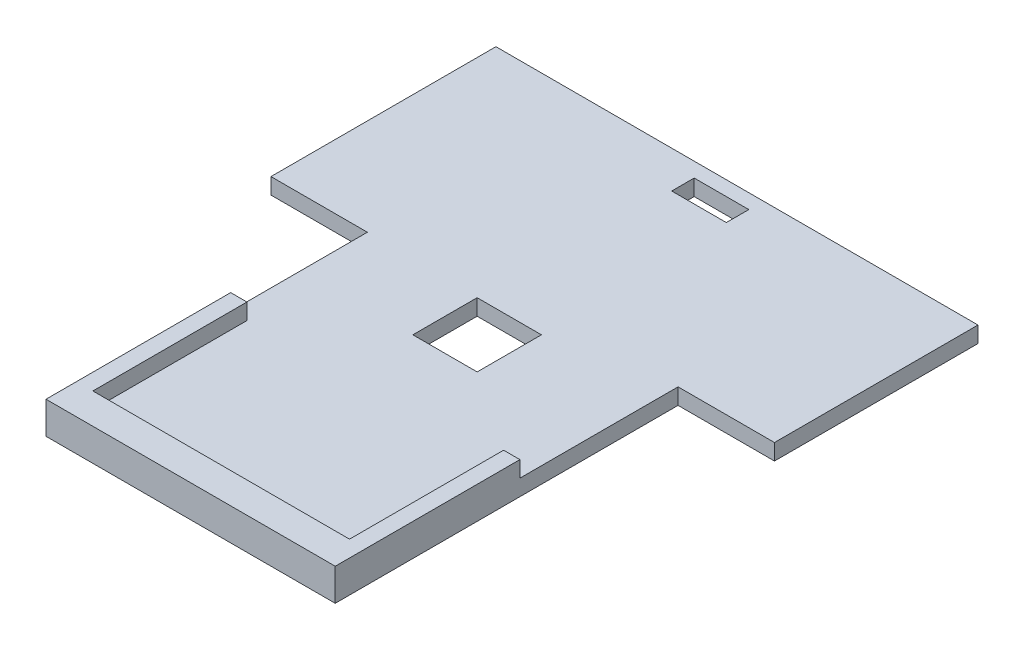
ISO-10303-21;
HEADER;
FILE_DESCRIPTION(('STEP AP214'),'2;1');
FILE_NAME('part.step','',(''),(''),'','','');
FILE_SCHEMA(('AUTOMOTIVE_DESIGN { 1 0 10303 214 1 1 1 1 }'));
ENDSEC;
DATA;
#1=APPLICATION_CONTEXT('core data for automotive mechanical design processes');
#2=APPLICATION_PROTOCOL_DEFINITION('international standard','automotive_design',2000,#1);
#3=PRODUCT_CONTEXT('',#1,'mechanical');
#4=PRODUCT('Part','Part','',(#3));
#5=PRODUCT_RELATED_PRODUCT_CATEGORY('part','',(#4));
#6=PRODUCT_DEFINITION_FORMATION('','',#4);
#7=PRODUCT_DEFINITION_CONTEXT('part definition',#1,'design');
#8=PRODUCT_DEFINITION('design','',#6,#7);
#9=PRODUCT_DEFINITION_SHAPE('','',#8);
#10=(LENGTH_UNIT() NAMED_UNIT(*) SI_UNIT(.MILLI.,.METRE.));
#11=(NAMED_UNIT(*) PLANE_ANGLE_UNIT() SI_UNIT($,.RADIAN.));
#12=(NAMED_UNIT(*) SI_UNIT($,.STERADIAN.) SOLID_ANGLE_UNIT());
#13=UNCERTAINTY_MEASURE_WITH_UNIT(LENGTH_MEASURE(1.E-05),#10,'distance_accuracy_value','');
#14=(GEOMETRIC_REPRESENTATION_CONTEXT(3) GLOBAL_UNCERTAINTY_ASSIGNED_CONTEXT((#13)) GLOBAL_UNIT_ASSIGNED_CONTEXT((#10,
#11,#12)) REPRESENTATION_CONTEXT('',''));
#15=CARTESIAN_POINT('',(0.,0.,0.));
#16=DIRECTION('',(0.,0.,1.));
#17=DIRECTION('',(1.,0.,0.));
#18=AXIS2_PLACEMENT_3D('',#15,#16,#17);
#19=CARTESIAN_POINT('',(0.,5.,0.));
#20=DIRECTION('',(0.,-1.,0.));
#21=DIRECTION('',(0.,0.,-1.));
#22=AXIS2_PLACEMENT_3D('',#19,#20,#21);
#23=PLANE('',#22);
#24=DIRECTION('',(0.,0.,-1.));
#25=VECTOR('',#24,1.);
#26=CARTESIAN_POINT('',(8.5210181174456,5.,-69.0142627843914));
#27=LINE('',#26,#25);
#28=CARTESIAN_POINT('',(8.5210181174456,5.,-69.0142627843914));
#29=VERTEX_POINT('',#28);
#30=CARTESIAN_POINT('',(8.5210181174456,5.,-76.0142627843914));
#31=VERTEX_POINT('',#30);
#32=EDGE_CURVE('E278',#29,#31,#27,.T.);
#33=ORIENTED_EDGE('',*,*,#32,.F.);
#34=DIRECTION('',(1.,0.,0.));
#35=VECTOR('',#34,1.);
#36=CARTESIAN_POINT('',(-8.4789818825544,5.,-69.0142627843914));
#37=LINE('',#36,#35);
#38=CARTESIAN_POINT('',(-8.4789818825544,5.,-69.0142627843914));
#39=VERTEX_POINT('',#38);
#40=EDGE_CURVE('E286',#39,#29,#37,.T.);
#41=ORIENTED_EDGE('',*,*,#40,.F.);
#42=DIRECTION('',(0.,0.,1.));
#43=VECTOR('',#42,1.);
#44=CARTESIAN_POINT('',(-8.4789818825544,5.,-69.0142627843914));
#45=LINE('',#44,#43);
#46=CARTESIAN_POINT('',(-8.4789818825544,5.,-76.0142627843914));
#47=VERTEX_POINT('',#46);
#48=EDGE_CURVE('E283',#47,#39,#45,.T.);
#49=ORIENTED_EDGE('',*,*,#48,.F.);
#50=DIRECTION('',(-1.,0.,0.));
#51=VECTOR('',#50,1.);
#52=CARTESIAN_POINT('',(-8.4789818825544,5.,-76.0142627843914));
#53=LINE('',#52,#51);
#54=EDGE_CURVE('E280',#31,#47,#53,.T.);
#55=ORIENTED_EDGE('',*,*,#54,.F.);
#56=EDGE_LOOP('',(#33,#41,#49,#55));
#57=FACE_BOUND('',#56,.T.);
#58=DIRECTION('',(-1.,0.,0.));
#59=VECTOR('',#58,1.);
#60=CARTESIAN_POINT('',(-10.,5.,-10.));
#61=LINE('',#60,#59);
#62=CARTESIAN_POINT('',(10.,5.,-10.));
#63=VERTEX_POINT('',#62);
#64=CARTESIAN_POINT('',(-10.,5.,-10.));
#65=VERTEX_POINT('',#64);
#66=EDGE_CURVE('E261',#63,#65,#61,.T.);
#67=ORIENTED_EDGE('',*,*,#66,.F.);
#68=DIRECTION('',(0.,0.,-1.));
#69=VECTOR('',#68,1.);
#70=CARTESIAN_POINT('',(10.,5.,10.));
#71=LINE('',#70,#69);
#72=CARTESIAN_POINT('',(10.,5.,10.));
#73=VERTEX_POINT('',#72);
#74=EDGE_CURVE('E205',#73,#63,#71,.T.);
#75=ORIENTED_EDGE('',*,*,#74,.F.);
#76=DIRECTION('',(1.,0.,0.));
#77=VECTOR('',#76,1.);
#78=CARTESIAN_POINT('',(-10.,5.,10.));
#79=LINE('',#78,#77);
#80=CARTESIAN_POINT('',(-10.,5.,10.));
#81=VERTEX_POINT('',#80);
#82=EDGE_CURVE('E250',#81,#73,#79,.T.);
#83=ORIENTED_EDGE('',*,*,#82,.F.);
#84=DIRECTION('',(0.,0.,1.));
#85=VECTOR('',#84,1.);
#86=CARTESIAN_POINT('',(-10.,5.,10.));
#87=LINE('',#86,#85);
#88=EDGE_CURVE('E264',#65,#81,#87,.T.);
#89=ORIENTED_EDGE('',*,*,#88,.F.);
#90=EDGE_LOOP('',(#67,#75,#83,#89));
#91=FACE_BOUND('',#90,.T.);
#92=DIRECTION('',(-1.,0.,0.));
#93=VECTOR('',#92,1.);
#94=CARTESIAN_POINT('',(-39.6505437221671,5.,31.9751991133616));
#95=LINE('',#94,#93);
#96=CARTESIAN_POINT('',(-39.6505437221671,5.,31.9751991133616));
#97=VERTEX_POINT('',#96);
#98=CARTESIAN_POINT('',(-44.7189818825544,5.,31.9751991133615));
#99=VERTEX_POINT('',#98);
#100=EDGE_CURVE('E53',#97,#99,#95,.T.);
#101=ORIENTED_EDGE('',*,*,#100,.F.);
#102=DIRECTION('',(0.,0.,-1.));
#103=VECTOR('',#102,1.);
#104=CARTESIAN_POINT('',(-39.6505437221671,5.,31.9751991133616));
#105=LINE('',#104,#103);
#106=CARTESIAN_POINT('',(-39.6505437221671,5.,79.9218394482392));
#107=VERTEX_POINT('',#106);
#108=EDGE_CURVE('E57',#107,#97,#105,.T.);
#109=ORIENTED_EDGE('',*,*,#108,.F.);
#110=DIRECTION('',(-1.,0.,0.));
#111=VECTOR('',#110,1.);
#112=CARTESIAN_POINT('',(-39.6505437221671,5.,79.9218394482392));
#113=LINE('',#112,#111);
#114=CARTESIAN_POINT('',(40.2125799570584,5.,79.9218394482392));
#115=VERTEX_POINT('',#114);
#116=EDGE_CURVE('E230',#115,#107,#113,.T.);
#117=ORIENTED_EDGE('',*,*,#116,.F.);
#118=DIRECTION('',(0.,0.,1.));
#119=VECTOR('',#118,1.);
#120=CARTESIAN_POINT('',(40.2125799570584,5.,31.9751991133616));
#121=LINE('',#120,#119);
#122=CARTESIAN_POINT('',(40.2125799570584,5.,31.9751991133616));
#123=VERTEX_POINT('',#122);
#124=EDGE_CURVE('E227',#123,#115,#121,.T.);
#125=ORIENTED_EDGE('',*,*,#124,.F.);
#126=DIRECTION('',(-1.,0.,0.));
#127=VECTOR('',#126,1.);
#128=CARTESIAN_POINT('',(40.2125799570584,5.,31.9751991133616));
#129=LINE('',#128,#127);
#130=CARTESIAN_POINT('',(45.2810181174456,5.,31.9751991133616));
#131=VERTEX_POINT('',#130);
#132=EDGE_CURVE('E225',#131,#123,#129,.T.);
#133=ORIENTED_EDGE('',*,*,#132,.F.);
#134=DIRECTION('',(0.,0.,-1.));
#135=VECTOR('',#134,1.);
#136=CARTESIAN_POINT('',(45.2810181174456,5.,-17.235484444561));
#137=LINE('',#136,#135);
#138=CARTESIAN_POINT('',(45.2810181174456,5.,-17.235484444561));
#139=VERTEX_POINT('',#138);
#140=EDGE_CURVE('E202',#131,#139,#137,.T.);
#141=ORIENTED_EDGE('',*,*,#140,.T.);
#142=DIRECTION('',(1.,0.,0.));
#143=VECTOR('',#142,1.);
#144=CARTESIAN_POINT('',(75.2810181174456,5.,-17.235484444561));
#145=LINE('',#144,#143);
#146=CARTESIAN_POINT('',(75.2810181174456,5.,-17.235484444561));
#147=VERTEX_POINT('',#146);
#148=EDGE_CURVE('E322',#139,#147,#145,.T.);
#149=ORIENTED_EDGE('',*,*,#148,.T.);
#150=DIRECTION('',(0.,0.,-1.));
#151=VECTOR('',#150,1.);
#152=CARTESIAN_POINT('',(75.2810181174456,5.,-17.235484444561));
#153=LINE('',#152,#151);
#154=CARTESIAN_POINT('',(75.2810181174456,5.,-80.5642627843914));
#155=VERTEX_POINT('',#154);
#156=EDGE_CURVE('E309',#147,#155,#153,.T.);
#157=ORIENTED_EDGE('',*,*,#156,.T.);
#158=DIRECTION('',(-1.,0.,0.));
#159=VECTOR('',#158,1.);
#160=CARTESIAN_POINT('',(-74.7189818825544,5.,-80.5642627843914));
#161=LINE('',#160,#159);
#162=CARTESIAN_POINT('',(-74.7189818825544,5.,-80.5642627843914));
#163=VERTEX_POINT('',#162);
#164=EDGE_CURVE('E312',#155,#163,#161,.T.);
#165=ORIENTED_EDGE('',*,*,#164,.T.);
#166=DIRECTION('',(0.,0.,1.));
#167=VECTOR('',#166,1.);
#168=CARTESIAN_POINT('',(-74.7189818825544,5.,-10.5642627843914));
#169=LINE('',#168,#167);
#170=CARTESIAN_POINT('',(-74.7189818825544,5.,-10.5642627843914));
#171=VERTEX_POINT('',#170);
#172=EDGE_CURVE('E315',#163,#171,#169,.T.);
#173=ORIENTED_EDGE('',*,*,#172,.T.);
#174=DIRECTION('',(1.,0.,0.));
#175=VECTOR('',#174,1.);
#176=CARTESIAN_POINT('',(-74.7189818825544,5.,-10.5642627843914));
#177=LINE('',#176,#175);
#178=CARTESIAN_POINT('',(-44.7189818825544,5.,-10.5642627843914));
#179=VERTEX_POINT('',#178);
#180=EDGE_CURVE('E317',#171,#179,#177,.T.);
#181=ORIENTED_EDGE('',*,*,#180,.T.);
#182=DIRECTION('',(0.,0.,1.));
#183=VECTOR('',#182,1.);
#184=CARTESIAN_POINT('',(-44.7189818825544,5.,-10.5642627843914));
#185=LINE('',#184,#183);
#186=EDGE_CURVE('E319',#179,#99,#185,.T.);
#187=ORIENTED_EDGE('',*,*,#186,.T.);
#188=EDGE_LOOP('',(#101,#109,#117,#125,#133,#141,#149,#157,#165,#173,#181,#187));
#189=FACE_BOUND('',#188,.T.);
#190=ADVANCED_FACE('F38',(#57,#91,#189),#23,.F.);
#191=CARTESIAN_POINT('',(0.,0.,0.));
#192=DIRECTION('',(0.,-1.,0.));
#193=DIRECTION('',(0.,0.,-1.));
#194=AXIS2_PLACEMENT_3D('',#191,#192,#193);
#195=PLANE('',#194);
#196=DIRECTION('',(0.,0.,-1.));
#197=VECTOR('',#196,1.);
#198=CARTESIAN_POINT('',(10.,0.,10.));
#199=LINE('',#198,#197);
#200=CARTESIAN_POINT('',(10.,0.,10.));
#201=VERTEX_POINT('',#200);
#202=CARTESIAN_POINT('',(10.,0.,-10.));
#203=VERTEX_POINT('',#202);
#204=EDGE_CURVE('E246',#201,#203,#199,.T.);
#205=ORIENTED_EDGE('',*,*,#204,.T.);
#206=DIRECTION('',(-1.,0.,0.));
#207=VECTOR('',#206,1.);
#208=CARTESIAN_POINT('',(-10.,0.,-10.));
#209=LINE('',#208,#207);
#210=CARTESIAN_POINT('',(-10.,0.,-10.));
#211=VERTEX_POINT('',#210);
#212=EDGE_CURVE('E249',#203,#211,#209,.T.);
#213=ORIENTED_EDGE('',*,*,#212,.T.);
#214=DIRECTION('',(0.,0.,1.));
#215=VECTOR('',#214,1.);
#216=CARTESIAN_POINT('',(-10.,0.,10.));
#217=LINE('',#216,#215);
#218=CARTESIAN_POINT('',(-10.,0.,10.));
#219=VERTEX_POINT('',#218);
#220=EDGE_CURVE('E253',#211,#219,#217,.T.);
#221=ORIENTED_EDGE('',*,*,#220,.T.);
#222=DIRECTION('',(1.,0.,0.));
#223=VECTOR('',#222,1.);
#224=CARTESIAN_POINT('',(-10.,0.,10.));
#225=LINE('',#224,#223);
#226=EDGE_CURVE('E256',#219,#201,#225,.T.);
#227=ORIENTED_EDGE('',*,*,#226,.T.);
#228=EDGE_LOOP('',(#205,#213,#221,#227));
#229=FACE_BOUND('',#228,.T.);
#230=DIRECTION('',(0.,0.,-1.));
#231=VECTOR('',#230,1.);
#232=CARTESIAN_POINT('',(75.2810181174456,0.,-17.235484444561));
#233=LINE('',#232,#231);
#234=CARTESIAN_POINT('',(75.2810181174456,0.,-17.235484444561));
#235=VERTEX_POINT('',#234);
#236=CARTESIAN_POINT('',(75.2810181174456,0.,-80.5642627843914));
#237=VERTEX_POINT('',#236);
#238=EDGE_CURVE('E308',#235,#237,#233,.T.);
#239=ORIENTED_EDGE('',*,*,#238,.F.);
#240=DIRECTION('',(1.,0.,0.));
#241=VECTOR('',#240,1.);
#242=CARTESIAN_POINT('',(75.2810181174456,0.,-17.235484444561));
#243=LINE('',#242,#241);
#244=CARTESIAN_POINT('',(45.2810181174456,0.,-17.235484444561));
#245=VERTEX_POINT('',#244);
#246=EDGE_CURVE('E313',#245,#235,#243,.T.);
#247=ORIENTED_EDGE('',*,*,#246,.F.);
#248=DIRECTION('',(0.,0.,-1.));
#249=VECTOR('',#248,1.);
#250=CARTESIAN_POINT('',(45.2810181174456,0.,-17.235484444561));
#251=LINE('',#250,#249);
#252=CARTESIAN_POINT('',(45.2810181174456,0.,89.4357372156085));
#253=VERTEX_POINT('',#252);
#254=EDGE_CURVE('E337',#253,#245,#251,.T.);
#255=ORIENTED_EDGE('',*,*,#254,.F.);
#256=DIRECTION('',(1.,0.,0.));
#257=VECTOR('',#256,1.);
#258=CARTESIAN_POINT('',(-44.7189818825544,0.,89.4357372156086));
#259=LINE('',#258,#257);
#260=CARTESIAN_POINT('',(-44.7189818825544,0.,89.4357372156086));
#261=VERTEX_POINT('',#260);
#262=EDGE_CURVE('E335',#261,#253,#259,.T.);
#263=ORIENTED_EDGE('',*,*,#262,.F.);
#264=DIRECTION('',(0.,0.,1.));
#265=VECTOR('',#264,1.);
#266=CARTESIAN_POINT('',(-44.7189818825544,0.,-10.5642627843914));
#267=LINE('',#266,#265);
#268=CARTESIAN_POINT('',(-44.7189818825544,0.,-10.5642627843914));
#269=VERTEX_POINT('',#268);
#270=EDGE_CURVE('E333',#269,#261,#267,.T.);
#271=ORIENTED_EDGE('',*,*,#270,.F.);
#272=DIRECTION('',(1.,0.,0.));
#273=VECTOR('',#272,1.);
#274=CARTESIAN_POINT('',(-74.7189818825544,0.,-10.5642627843914));
#275=LINE('',#274,#273);
#276=CARTESIAN_POINT('',(-74.7189818825544,0.,-10.5642627843914));
#277=VERTEX_POINT('',#276);
#278=EDGE_CURVE('E331',#277,#269,#275,.T.);
#279=ORIENTED_EDGE('',*,*,#278,.F.);
#280=DIRECTION('',(0.,0.,1.));
#281=VECTOR('',#280,1.);
#282=CARTESIAN_POINT('',(-74.7189818825544,0.,-10.5642627843914));
#283=LINE('',#282,#281);
#284=CARTESIAN_POINT('',(-74.7189818825544,0.,-80.5642627843914));
#285=VERTEX_POINT('',#284);
#286=EDGE_CURVE('E329',#285,#277,#283,.T.);
#287=ORIENTED_EDGE('',*,*,#286,.F.);
#288=DIRECTION('',(-1.,0.,0.));
#289=VECTOR('',#288,1.);
#290=CARTESIAN_POINT('',(-74.7189818825544,0.,-80.5642627843914));
#291=LINE('',#290,#289);
#292=EDGE_CURVE('E327',#237,#285,#291,.T.);
#293=ORIENTED_EDGE('',*,*,#292,.F.);
#294=EDGE_LOOP('',(#239,#247,#255,#263,#271,#279,#287,#293));
#295=FACE_BOUND('',#294,.T.);
#296=DIRECTION('',(1.,0.,0.));
#297=VECTOR('',#296,1.);
#298=CARTESIAN_POINT('',(-8.4789818825544,0.,-69.0142627843914));
#299=LINE('',#298,#297);
#300=CARTESIAN_POINT('',(-8.4789818825544,0.,-69.0142627843914));
#301=VERTEX_POINT('',#300);
#302=CARTESIAN_POINT('',(8.5210181174456,0.,-69.0142627843914));
#303=VERTEX_POINT('',#302);
#304=EDGE_CURVE('E281',#301,#303,#299,.T.);
#305=ORIENTED_EDGE('',*,*,#304,.T.);
#306=DIRECTION('',(0.,0.,-1.));
#307=VECTOR('',#306,1.);
#308=CARTESIAN_POINT('',(8.5210181174456,0.,-69.0142627843914));
#309=LINE('',#308,#307);
#310=CARTESIAN_POINT('',(8.5210181174456,0.,-76.0142627843914));
#311=VERTEX_POINT('',#310);
#312=EDGE_CURVE('E271',#303,#311,#309,.T.);
#313=ORIENTED_EDGE('',*,*,#312,.T.);
#314=DIRECTION('',(-1.,0.,0.));
#315=VECTOR('',#314,1.);
#316=CARTESIAN_POINT('',(-8.4789818825544,0.,-76.0142627843914));
#317=LINE('',#316,#315);
#318=CARTESIAN_POINT('',(-8.4789818825544,0.,-76.0142627843914));
#319=VERTEX_POINT('',#318);
#320=EDGE_CURVE('E291',#311,#319,#317,.T.);
#321=ORIENTED_EDGE('',*,*,#320,.T.);
#322=DIRECTION('',(0.,0.,1.));
#323=VECTOR('',#322,1.);
#324=CARTESIAN_POINT('',(-8.4789818825544,0.,-69.0142627843914));
#325=LINE('',#324,#323);
#326=EDGE_CURVE('E294',#319,#301,#325,.T.);
#327=ORIENTED_EDGE('',*,*,#326,.T.);
#328=EDGE_LOOP('',(#305,#313,#321,#327));
#329=FACE_BOUND('',#328,.T.);
#330=ADVANCED_FACE('F366',(#229,#295,#329),#195,.T.);
#331=CARTESIAN_POINT('',(75.2810181174456,5.,-17.235484444561));
#332=DIRECTION('',(-1.,0.,0.));
#333=DIRECTION('',(0.,0.,1.));
#334=AXIS2_PLACEMENT_3D('',#331,#332,#333);
#335=PLANE('',#334);
#336=ORIENTED_EDGE('',*,*,#238,.T.);
#337=DIRECTION('',(0.,-1.,0.));
#338=VECTOR('',#337,1.);
#339=CARTESIAN_POINT('',(75.2810181174456,5.,-80.5642627843914));
#340=LINE('',#339,#338);
#341=EDGE_CURVE('E11',#155,#237,#340,.T.);
#342=ORIENTED_EDGE('',*,*,#341,.F.);
#343=ORIENTED_EDGE('',*,*,#156,.F.);
#344=DIRECTION('',(0.,-1.,0.));
#345=VECTOR('',#344,1.);
#346=CARTESIAN_POINT('',(75.2810181174456,5.,-17.235484444561));
#347=LINE('',#346,#345);
#348=EDGE_CURVE('E324',#147,#235,#347,.T.);
#349=ORIENTED_EDGE('',*,*,#348,.T.);
#350=EDGE_LOOP('',(#336,#342,#343,#349));
#351=FACE_BOUND('',#350,.T.);
#352=ADVANCED_FACE('F40',(#351),#335,.F.);
#353=CARTESIAN_POINT('',(-74.7189818825544,5.,-80.5642627843914));
#354=DIRECTION('',(0.,0.,1.));
#355=DIRECTION('',(1.,0.,0.));
#356=AXIS2_PLACEMENT_3D('',#353,#354,#355);
#357=PLANE('',#356);
#358=ORIENTED_EDGE('',*,*,#292,.T.);
#359=DIRECTION('',(0.,-1.,0.));
#360=VECTOR('',#359,1.);
#361=CARTESIAN_POINT('',(-74.7189818825544,5.,-80.5642627843914));
#362=LINE('',#361,#360);
#363=EDGE_CURVE('E46',#163,#285,#362,.T.);
#364=ORIENTED_EDGE('',*,*,#363,.F.);
#365=ORIENTED_EDGE('',*,*,#164,.F.);
#366=ORIENTED_EDGE('',*,*,#341,.T.);
#367=EDGE_LOOP('',(#358,#364,#365,#366));
#368=FACE_BOUND('',#367,.T.);
#369=ADVANCED_FACE('F404',(#368),#357,.F.);
#370=CARTESIAN_POINT('',(-74.7189818825544,5.,-10.5642627843914));
#371=DIRECTION('',(1.,0.,0.));
#372=DIRECTION('',(0.,0.,-1.));
#373=AXIS2_PLACEMENT_3D('',#370,#371,#372);
#374=PLANE('',#373);
#375=ORIENTED_EDGE('',*,*,#286,.T.);
#376=DIRECTION('',(0.,-1.,0.));
#377=VECTOR('',#376,1.);
#378=CARTESIAN_POINT('',(-74.7189818825544,5.,-10.5642627843914));
#379=LINE('',#378,#377);
#380=EDGE_CURVE('E353',#171,#277,#379,.T.);
#381=ORIENTED_EDGE('',*,*,#380,.F.);
#382=ORIENTED_EDGE('',*,*,#172,.F.);
#383=ORIENTED_EDGE('',*,*,#363,.T.);
#384=EDGE_LOOP('',(#375,#381,#382,#383));
#385=FACE_BOUND('',#384,.T.);
#386=ADVANCED_FACE('F360',(#385),#374,.F.);
#387=CARTESIAN_POINT('',(-74.7189818825544,5.,-10.5642627843914));
#388=DIRECTION('',(0.,0.,-1.));
#389=DIRECTION('',(-1.,0.,0.));
#390=AXIS2_PLACEMENT_3D('',#387,#388,#389);
#391=PLANE('',#390);
#392=ORIENTED_EDGE('',*,*,#278,.T.);
#393=DIRECTION('',(0.,-1.,0.));
#394=VECTOR('',#393,1.);
#395=CARTESIAN_POINT('',(-44.7189818825544,5.,-10.5642627843914));
#396=LINE('',#395,#394);
#397=EDGE_CURVE('E350',#179,#269,#396,.T.);
#398=ORIENTED_EDGE('',*,*,#397,.F.);
#399=ORIENTED_EDGE('',*,*,#180,.F.);
#400=ORIENTED_EDGE('',*,*,#380,.T.);
#401=EDGE_LOOP('',(#392,#398,#399,#400));
#402=FACE_BOUND('',#401,.T.);
#403=ADVANCED_FACE('F372',(#402),#391,.F.);
#404=CARTESIAN_POINT('',(-44.7189818825544,5.,-10.5642627843914));
#405=DIRECTION('',(1.,0.,0.));
#406=DIRECTION('',(0.,0.,-1.));
#407=AXIS2_PLACEMENT_3D('',#404,#405,#406);
#408=PLANE('',#407);
#409=ORIENTED_EDGE('',*,*,#270,.T.);
#410=DIRECTION('',(0.,-1.,0.));
#411=VECTOR('',#410,1.);
#412=CARTESIAN_POINT('',(-44.7189818825544,5.,89.4357372156086));
#413=LINE('',#412,#411);
#414=CARTESIAN_POINT('',(-44.7189818825544,10.,89.4357372156085));
#415=VERTEX_POINT('',#414);
#416=EDGE_CURVE('E347',#415,#261,#413,.T.);
#417=ORIENTED_EDGE('',*,*,#416,.F.);
#418=DIRECTION('',(0.,0.,1.));
#419=VECTOR('',#418,1.);
#420=CARTESIAN_POINT('',(-44.7189818825544,10.,31.9751991133616));
#421=LINE('',#420,#419);
#422=CARTESIAN_POINT('',(-44.7189818825544,10.,31.9751991133616));
#423=VERTEX_POINT('',#422);
#424=EDGE_CURVE('E221',#423,#415,#421,.T.);
#425=ORIENTED_EDGE('',*,*,#424,.F.);
#426=DIRECTION('',(0.,-1.,0.));
#427=VECTOR('',#426,1.);
#428=CARTESIAN_POINT('',(-44.7189818825544,10.,31.9751991133616));
#429=LINE('',#428,#427);
#430=EDGE_CURVE('E224',#423,#99,#429,.T.);
#431=ORIENTED_EDGE('',*,*,#430,.T.);
#432=ORIENTED_EDGE('',*,*,#186,.F.);
#433=ORIENTED_EDGE('',*,*,#397,.T.);
#434=EDGE_LOOP('',(#409,#417,#425,#431,#432,#433));
#435=FACE_BOUND('',#434,.T.);
#436=ADVANCED_FACE('F376',(#435),#408,.F.);
#437=CARTESIAN_POINT('',(-44.7189818825544,5.,89.4357372156086));
#438=DIRECTION('',(0.,0.,-1.));
#439=DIRECTION('',(-1.,0.,0.));
#440=AXIS2_PLACEMENT_3D('',#437,#438,#439);
#441=PLANE('',#440);
#442=ORIENTED_EDGE('',*,*,#262,.T.);
#443=DIRECTION('',(0.,-1.,0.));
#444=VECTOR('',#443,1.);
#445=CARTESIAN_POINT('',(45.2810181174456,5.,89.4357372156085));
#446=LINE('',#445,#444);
#447=CARTESIAN_POINT('',(45.2810181174456,10.,89.4357372156085));
#448=VERTEX_POINT('',#447);
#449=EDGE_CURVE('E345',#448,#253,#446,.T.);
#450=ORIENTED_EDGE('',*,*,#449,.F.);
#451=DIRECTION('',(1.,0.,0.));
#452=VECTOR('',#451,1.);
#453=CARTESIAN_POINT('',(-44.7189818825544,10.,89.4357372156085));
#454=LINE('',#453,#452);
#455=EDGE_CURVE('E193',#415,#448,#454,.T.);
#456=ORIENTED_EDGE('',*,*,#455,.F.);
#457=ORIENTED_EDGE('',*,*,#416,.T.);
#458=EDGE_LOOP('',(#442,#450,#456,#457));
#459=FACE_BOUND('',#458,.T.);
#460=ADVANCED_FACE('F394',(#459),#441,.F.);
#461=CARTESIAN_POINT('',(45.2810181174456,5.,-17.235484444561));
#462=DIRECTION('',(-1.,0.,0.));
#463=DIRECTION('',(0.,0.,1.));
#464=AXIS2_PLACEMENT_3D('',#461,#462,#463);
#465=PLANE('',#464);
#466=ORIENTED_EDGE('',*,*,#254,.T.);
#467=DIRECTION('',(0.,-1.,0.));
#468=VECTOR('',#467,1.);
#469=CARTESIAN_POINT('',(45.2810181174456,5.,-17.235484444561));
#470=LINE('',#469,#468);
#471=EDGE_CURVE('E342',#139,#245,#470,.T.);
#472=ORIENTED_EDGE('',*,*,#471,.F.);
#473=ORIENTED_EDGE('',*,*,#140,.F.);
#474=DIRECTION('',(0.,-1.,0.));
#475=VECTOR('',#474,1.);
#476=CARTESIAN_POINT('',(45.2810181174456,10.,31.9751991133616));
#477=LINE('',#476,#475);
#478=CARTESIAN_POINT('',(45.2810181174456,10.,31.9751991133616));
#479=VERTEX_POINT('',#478);
#480=EDGE_CURVE('E199',#479,#131,#477,.T.);
#481=ORIENTED_EDGE('',*,*,#480,.F.);
#482=DIRECTION('',(0.,0.,-1.));
#483=VECTOR('',#482,1.);
#484=CARTESIAN_POINT('',(45.2810181174456,10.,79.9218394482392));
#485=LINE('',#484,#483);
#486=EDGE_CURVE('E185',#448,#479,#485,.T.);
#487=ORIENTED_EDGE('',*,*,#486,.F.);
#488=ORIENTED_EDGE('',*,*,#449,.T.);
#489=EDGE_LOOP('',(#466,#472,#473,#481,#487,#488));
#490=FACE_BOUND('',#489,.T.);
#491=ADVANCED_FACE('F200',(#490),#465,.F.);
#492=CARTESIAN_POINT('',(75.2810181174456,5.,-17.235484444561));
#493=DIRECTION('',(0.,0.,-1.));
#494=DIRECTION('',(-1.,0.,0.));
#495=AXIS2_PLACEMENT_3D('',#492,#493,#494);
#496=PLANE('',#495);
#497=ORIENTED_EDGE('',*,*,#246,.T.);
#498=ORIENTED_EDGE('',*,*,#348,.F.);
#499=ORIENTED_EDGE('',*,*,#148,.F.);
#500=ORIENTED_EDGE('',*,*,#471,.T.);
#501=EDGE_LOOP('',(#497,#498,#499,#500));
#502=FACE_BOUND('',#501,.T.);
#503=ADVANCED_FACE('F399',(#502),#496,.F.);
#504=CARTESIAN_POINT('',(8.5210181174456,5.,-69.0142627843914));
#505=DIRECTION('',(-1.,0.,0.));
#506=DIRECTION('',(0.,0.,1.));
#507=AXIS2_PLACEMENT_3D('',#504,#505,#506);
#508=PLANE('',#507);
#509=ORIENTED_EDGE('',*,*,#312,.F.);
#510=DIRECTION('',(0.,-1.,0.));
#511=VECTOR('',#510,1.);
#512=CARTESIAN_POINT('',(8.5210181174456,5.,-69.0142627843914));
#513=LINE('',#512,#511);
#514=EDGE_CURVE('E288',#29,#303,#513,.T.);
#515=ORIENTED_EDGE('',*,*,#514,.F.);
#516=ORIENTED_EDGE('',*,*,#32,.T.);
#517=DIRECTION('',(0.,-1.,0.));
#518=VECTOR('',#517,1.);
#519=CARTESIAN_POINT('',(8.5210181174456,5.,-76.0142627843914));
#520=LINE('',#519,#518);
#521=EDGE_CURVE('E305',#31,#311,#520,.T.);
#522=ORIENTED_EDGE('',*,*,#521,.T.);
#523=EDGE_LOOP('',(#509,#515,#516,#522));
#524=FACE_BOUND('',#523,.T.);
#525=ADVANCED_FACE('F424',(#524),#508,.T.);
#526=CARTESIAN_POINT('',(-8.4789818825544,5.,-76.0142627843914));
#527=DIRECTION('',(0.,0.,1.));
#528=DIRECTION('',(1.,0.,0.));
#529=AXIS2_PLACEMENT_3D('',#526,#527,#528);
#530=PLANE('',#529);
#531=ORIENTED_EDGE('',*,*,#320,.F.);
#532=ORIENTED_EDGE('',*,*,#521,.F.);
#533=ORIENTED_EDGE('',*,*,#54,.T.);
#534=DIRECTION('',(0.,-1.,0.));
#535=VECTOR('',#534,1.);
#536=CARTESIAN_POINT('',(-8.4789818825544,5.,-76.0142627843914));
#537=LINE('',#536,#535);
#538=EDGE_CURVE('E303',#47,#319,#537,.T.);
#539=ORIENTED_EDGE('',*,*,#538,.T.);
#540=EDGE_LOOP('',(#531,#532,#533,#539));
#541=FACE_BOUND('',#540,.T.);
#542=ADVANCED_FACE('F450',(#541),#530,.T.);
#543=CARTESIAN_POINT('',(-8.4789818825544,5.,-69.0142627843914));
#544=DIRECTION('',(1.,0.,0.));
#545=DIRECTION('',(0.,0.,-1.));
#546=AXIS2_PLACEMENT_3D('',#543,#544,#545);
#547=PLANE('',#546);
#548=ORIENTED_EDGE('',*,*,#326,.F.);
#549=ORIENTED_EDGE('',*,*,#538,.F.);
#550=ORIENTED_EDGE('',*,*,#48,.T.);
#551=DIRECTION('',(0.,-1.,0.));
#552=VECTOR('',#551,1.);
#553=CARTESIAN_POINT('',(-8.4789818825544,5.,-69.0142627843914));
#554=LINE('',#553,#552);
#555=EDGE_CURVE('E301',#39,#301,#554,.T.);
#556=ORIENTED_EDGE('',*,*,#555,.T.);
#557=EDGE_LOOP('',(#548,#549,#550,#556));
#558=FACE_BOUND('',#557,.T.);
#559=ADVANCED_FACE('F457',(#558),#547,.T.);
#560=CARTESIAN_POINT('',(-8.4789818825544,5.,-69.0142627843914));
#561=DIRECTION('',(0.,0.,-1.));
#562=DIRECTION('',(-1.,0.,0.));
#563=AXIS2_PLACEMENT_3D('',#560,#561,#562);
#564=PLANE('',#563);
#565=ORIENTED_EDGE('',*,*,#304,.F.);
#566=ORIENTED_EDGE('',*,*,#555,.F.);
#567=ORIENTED_EDGE('',*,*,#40,.T.);
#568=ORIENTED_EDGE('',*,*,#514,.T.);
#569=EDGE_LOOP('',(#565,#566,#567,#568));
#570=FACE_BOUND('',#569,.T.);
#571=ADVANCED_FACE('F464',(#570),#564,.T.);
#572=CARTESIAN_POINT('',(10.,0.,10.));
#573=DIRECTION('',(1.,0.,0.));
#574=DIRECTION('',(0.,0.,-1.));
#575=AXIS2_PLACEMENT_3D('',#572,#573,#574);
#576=PLANE('',#575);
#577=ORIENTED_EDGE('',*,*,#74,.T.);
#578=DIRECTION('',(0.,1.,0.));
#579=VECTOR('',#578,1.);
#580=CARTESIAN_POINT('',(10.,0.,-10.));
#581=LINE('',#580,#579);
#582=EDGE_CURVE('E259',#203,#63,#581,.T.);
#583=ORIENTED_EDGE('',*,*,#582,.F.);
#584=ORIENTED_EDGE('',*,*,#204,.F.);
#585=DIRECTION('',(0.,1.,0.));
#586=VECTOR('',#585,1.);
#587=CARTESIAN_POINT('',(10.,0.,10.));
#588=LINE('',#587,#586);
#589=EDGE_CURVE('E269',#201,#73,#588,.T.);
#590=ORIENTED_EDGE('',*,*,#589,.T.);
#591=EDGE_LOOP('',(#577,#583,#584,#590));
#592=FACE_BOUND('',#591,.T.);
#593=ADVANCED_FACE('F472',(#592),#576,.F.);
#594=CARTESIAN_POINT('',(-10.,0.,10.));
#595=DIRECTION('',(0.,0.,1.));
#596=DIRECTION('',(1.,0.,0.));
#597=AXIS2_PLACEMENT_3D('',#594,#595,#596);
#598=PLANE('',#597);
#599=ORIENTED_EDGE('',*,*,#82,.T.);
#600=ORIENTED_EDGE('',*,*,#589,.F.);
#601=ORIENTED_EDGE('',*,*,#226,.F.);
#602=DIRECTION('',(0.,1.,0.));
#603=VECTOR('',#602,1.);
#604=CARTESIAN_POINT('',(-10.,0.,10.));
#605=LINE('',#604,#603);
#606=EDGE_CURVE('E272',#219,#81,#605,.T.);
#607=ORIENTED_EDGE('',*,*,#606,.T.);
#608=EDGE_LOOP('',(#599,#600,#601,#607));
#609=FACE_BOUND('',#608,.T.);
#610=ADVANCED_FACE('F481',(#609),#598,.F.);
#611=CARTESIAN_POINT('',(-10.,0.,10.));
#612=DIRECTION('',(-1.,0.,0.));
#613=DIRECTION('',(0.,0.,1.));
#614=AXIS2_PLACEMENT_3D('',#611,#612,#613);
#615=PLANE('',#614);
#616=ORIENTED_EDGE('',*,*,#88,.T.);
#617=ORIENTED_EDGE('',*,*,#606,.F.);
#618=ORIENTED_EDGE('',*,*,#220,.F.);
#619=DIRECTION('',(0.,1.,0.));
#620=VECTOR('',#619,1.);
#621=CARTESIAN_POINT('',(-10.,0.,-10.));
#622=LINE('',#621,#620);
#623=EDGE_CURVE('E274',#211,#65,#622,.T.);
#624=ORIENTED_EDGE('',*,*,#623,.T.);
#625=EDGE_LOOP('',(#616,#617,#618,#624));
#626=FACE_BOUND('',#625,.T.);
#627=ADVANCED_FACE('F489',(#626),#615,.F.);
#628=CARTESIAN_POINT('',(-10.,0.,-10.));
#629=DIRECTION('',(0.,0.,-1.));
#630=DIRECTION('',(-1.,0.,0.));
#631=AXIS2_PLACEMENT_3D('',#628,#629,#630);
#632=PLANE('',#631);
#633=ORIENTED_EDGE('',*,*,#66,.T.);
#634=ORIENTED_EDGE('',*,*,#623,.F.);
#635=ORIENTED_EDGE('',*,*,#212,.F.);
#636=ORIENTED_EDGE('',*,*,#582,.T.);
#637=EDGE_LOOP('',(#633,#634,#635,#636));
#638=FACE_BOUND('',#637,.T.);
#639=ADVANCED_FACE('F497',(#638),#632,.F.);
#640=CARTESIAN_POINT('',(40.2125799570584,10.,31.9751991133616));
#641=DIRECTION('',(0.,0.,1.));
#642=DIRECTION('',(1.,0.,0.));
#643=AXIS2_PLACEMENT_3D('',#640,#641,#642);
#644=PLANE('',#643);
#645=ORIENTED_EDGE('',*,*,#132,.T.);
#646=DIRECTION('',(0.,-1.,0.));
#647=VECTOR('',#646,1.);
#648=CARTESIAN_POINT('',(40.2125799570584,10.,31.9751991133616));
#649=LINE('',#648,#647);
#650=CARTESIAN_POINT('',(40.2125799570584,10.,31.9751991133616));
#651=VERTEX_POINT('',#650);
#652=EDGE_CURVE('E206',#651,#123,#649,.T.);
#653=ORIENTED_EDGE('',*,*,#652,.F.);
#654=DIRECTION('',(-1.,0.,0.));
#655=VECTOR('',#654,1.);
#656=CARTESIAN_POINT('',(40.2125799570584,10.,31.9751991133616));
#657=LINE('',#656,#655);
#658=EDGE_CURVE('E189',#479,#651,#657,.T.);
#659=ORIENTED_EDGE('',*,*,#658,.F.);
#660=ORIENTED_EDGE('',*,*,#480,.T.);
#661=EDGE_LOOP('',(#645,#653,#659,#660));
#662=FACE_BOUND('',#661,.T.);
#663=ADVANCED_FACE('F208',(#662),#644,.F.);
#664=CARTESIAN_POINT('',(40.2125799570584,10.,31.9751991133616));
#665=DIRECTION('',(1.,0.,0.));
#666=DIRECTION('',(0.,0.,-1.));
#667=AXIS2_PLACEMENT_3D('',#664,#665,#666);
#668=PLANE('',#667);
#669=ORIENTED_EDGE('',*,*,#124,.T.);
#670=DIRECTION('',(0.,-1.,0.));
#671=VECTOR('',#670,1.);
#672=CARTESIAN_POINT('',(40.2125799570584,10.,79.9218394482392));
#673=LINE('',#672,#671);
#674=CARTESIAN_POINT('',(40.2125799570584,10.,79.9218394482392));
#675=VERTEX_POINT('',#674);
#676=EDGE_CURVE('E242',#675,#115,#673,.T.);
#677=ORIENTED_EDGE('',*,*,#676,.F.);
#678=DIRECTION('',(0.,0.,1.));
#679=VECTOR('',#678,1.);
#680=CARTESIAN_POINT('',(40.2125799570584,10.,31.9751991133616));
#681=LINE('',#680,#679);
#682=EDGE_CURVE('E211',#651,#675,#681,.T.);
#683=ORIENTED_EDGE('',*,*,#682,.F.);
#684=ORIENTED_EDGE('',*,*,#652,.T.);
#685=EDGE_LOOP('',(#669,#677,#683,#684));
#686=FACE_BOUND('',#685,.T.);
#687=ADVANCED_FACE('F392',(#686),#668,.F.);
#688=CARTESIAN_POINT('',(-39.6505437221671,10.,79.9218394482392));
#689=DIRECTION('',(0.,0.,1.));
#690=DIRECTION('',(1.,0.,0.));
#691=AXIS2_PLACEMENT_3D('',#688,#689,#690);
#692=PLANE('',#691);
#693=ORIENTED_EDGE('',*,*,#116,.T.);
#694=DIRECTION('',(0.,-1.,0.));
#695=VECTOR('',#694,1.);
#696=CARTESIAN_POINT('',(-39.6505437221671,10.,79.9218394482392));
#697=LINE('',#696,#695);
#698=CARTESIAN_POINT('',(-39.6505437221671,10.,79.9218394482392));
#699=VERTEX_POINT('',#698);
#700=EDGE_CURVE('E239',#699,#107,#697,.T.);
#701=ORIENTED_EDGE('',*,*,#700,.F.);
#702=DIRECTION('',(-1.,0.,0.));
#703=VECTOR('',#702,1.);
#704=CARTESIAN_POINT('',(-39.6505437221671,10.,79.9218394482392));
#705=LINE('',#704,#703);
#706=EDGE_CURVE('E213',#675,#699,#705,.T.);
#707=ORIENTED_EDGE('',*,*,#706,.F.);
#708=ORIENTED_EDGE('',*,*,#676,.T.);
#709=EDGE_LOOP('',(#693,#701,#707,#708));
#710=FACE_BOUND('',#709,.T.);
#711=ADVANCED_FACE('F389',(#710),#692,.F.);
#712=CARTESIAN_POINT('',(-39.6505437221671,10.,31.9751991133616));
#713=DIRECTION('',(-1.,0.,0.));
#714=DIRECTION('',(0.,0.,1.));
#715=AXIS2_PLACEMENT_3D('',#712,#713,#714);
#716=PLANE('',#715);
#717=ORIENTED_EDGE('',*,*,#108,.T.);
#718=DIRECTION('',(0.,-1.,0.));
#719=VECTOR('',#718,1.);
#720=CARTESIAN_POINT('',(-39.6505437221671,10.,31.9751991133616));
#721=LINE('',#720,#719);
#722=CARTESIAN_POINT('',(-39.6505437221671,10.,31.9751991133616));
#723=VERTEX_POINT('',#722);
#724=EDGE_CURVE('E236',#723,#97,#721,.T.);
#725=ORIENTED_EDGE('',*,*,#724,.F.);
#726=DIRECTION('',(0.,0.,-1.));
#727=VECTOR('',#726,1.);
#728=CARTESIAN_POINT('',(-39.6505437221671,10.,31.9751991133616));
#729=LINE('',#728,#727);
#730=EDGE_CURVE('E217',#699,#723,#729,.T.);
#731=ORIENTED_EDGE('',*,*,#730,.F.);
#732=ORIENTED_EDGE('',*,*,#700,.T.);
#733=EDGE_LOOP('',(#717,#725,#731,#732));
#734=FACE_BOUND('',#733,.T.);
#735=ADVANCED_FACE('F385',(#734),#716,.F.);
#736=CARTESIAN_POINT('',(-39.6505437221671,10.,31.9751991133616));
#737=DIRECTION('',(0.,0.,1.));
#738=DIRECTION('',(1.,0.,0.));
#739=AXIS2_PLACEMENT_3D('',#736,#737,#738);
#740=PLANE('',#739);
#741=ORIENTED_EDGE('',*,*,#100,.T.);
#742=ORIENTED_EDGE('',*,*,#430,.F.);
#743=DIRECTION('',(-1.,0.,0.));
#744=VECTOR('',#743,1.);
#745=CARTESIAN_POINT('',(-39.6505437221671,10.,31.9751991133616));
#746=LINE('',#745,#744);
#747=EDGE_CURVE('E219',#723,#423,#746,.T.);
#748=ORIENTED_EDGE('',*,*,#747,.F.);
#749=ORIENTED_EDGE('',*,*,#724,.T.);
#750=EDGE_LOOP('',(#741,#742,#748,#749));
#751=FACE_BOUND('',#750,.T.);
#752=ADVANCED_FACE('F380',(#751),#740,.F.);
#753=CARTESIAN_POINT('',(0.,10.,0.));
#754=DIRECTION('',(0.,1.,0.));
#755=DIRECTION('',(0.,0.,1.));
#756=AXIS2_PLACEMENT_3D('',#753,#754,#755);
#757=PLANE('',#756);
#758=ORIENTED_EDGE('',*,*,#486,.T.);
#759=ORIENTED_EDGE('',*,*,#658,.T.);
#760=ORIENTED_EDGE('',*,*,#682,.T.);
#761=ORIENTED_EDGE('',*,*,#706,.T.);
#762=ORIENTED_EDGE('',*,*,#730,.T.);
#763=ORIENTED_EDGE('',*,*,#747,.T.);
#764=ORIENTED_EDGE('',*,*,#424,.T.);
#765=ORIENTED_EDGE('',*,*,#455,.T.);
#766=EDGE_LOOP('',(#758,#759,#760,#761,#762,#763,#764,#765));
#767=FACE_BOUND('',#766,.T.);
#768=ADVANCED_FACE('F187',(#767),#757,.T.);
#769=CLOSED_SHELL('',(#190,#330,#352,#369,#386,#403,#436,#460,#491,#503,#525,#542,#559,#571,
#593,#610,#627,#639,#663,#687,#711,#735,#752,#768));
#770=MANIFOLD_SOLID_BREP('B2',#769);
#771=ADVANCED_BREP_SHAPE_REPRESENTATION('',(#18,#770),#14);
#772=SHAPE_DEFINITION_REPRESENTATION(#9,#771);
ENDSEC;
END-ISO-10303-21;
